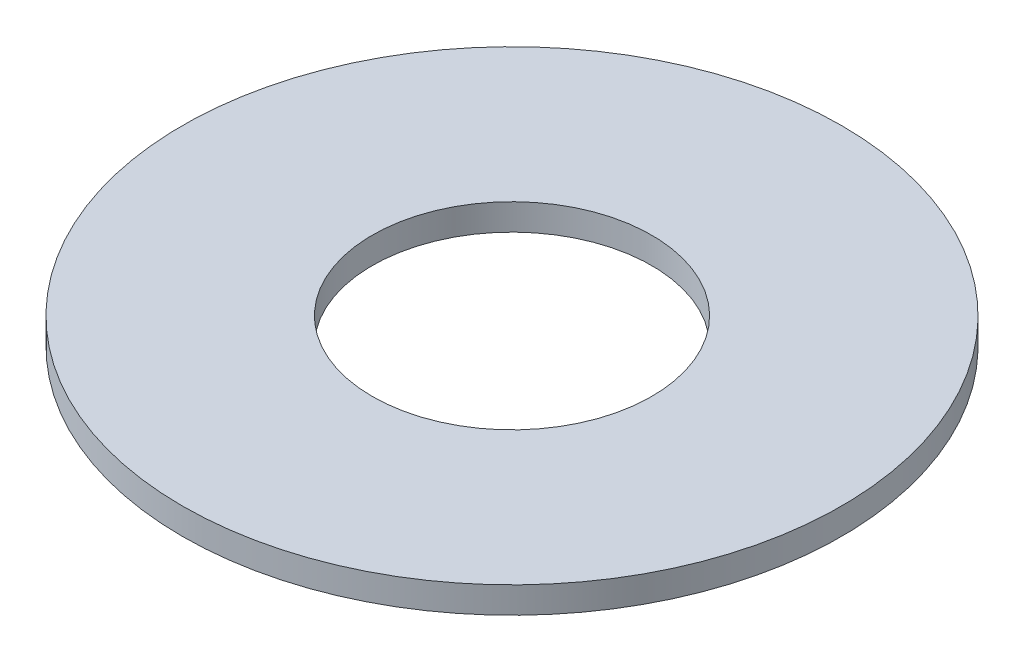
ISO-10303-21;
HEADER;
FILE_DESCRIPTION(('STEP AP214'),'2;1');
FILE_NAME('part.step','',(''),(''),'','','');
FILE_SCHEMA(('AUTOMOTIVE_DESIGN { 1 0 10303 214 1 1 1 1 }'));
ENDSEC;
DATA;
#1=APPLICATION_CONTEXT('core data for automotive mechanical design processes');
#2=APPLICATION_PROTOCOL_DEFINITION('international standard','automotive_design',2000,#1);
#3=PRODUCT_CONTEXT('',#1,'mechanical');
#4=PRODUCT('Part','Part','',(#3));
#5=PRODUCT_RELATED_PRODUCT_CATEGORY('part','',(#4));
#6=PRODUCT_DEFINITION_FORMATION('','',#4);
#7=PRODUCT_DEFINITION_CONTEXT('part definition',#1,'design');
#8=PRODUCT_DEFINITION('design','',#6,#7);
#9=PRODUCT_DEFINITION_SHAPE('','',#8);
#10=(LENGTH_UNIT() NAMED_UNIT(*) SI_UNIT(.MILLI.,.METRE.));
#11=(NAMED_UNIT(*) PLANE_ANGLE_UNIT() SI_UNIT($,.RADIAN.));
#12=(NAMED_UNIT(*) SI_UNIT($,.STERADIAN.) SOLID_ANGLE_UNIT());
#13=UNCERTAINTY_MEASURE_WITH_UNIT(LENGTH_MEASURE(1.E-05),#10,'distance_accuracy_value','');
#14=(GEOMETRIC_REPRESENTATION_CONTEXT(3) GLOBAL_UNCERTAINTY_ASSIGNED_CONTEXT((#13)) GLOBAL_UNIT_ASSIGNED_CONTEXT((#10,
#11,#12)) REPRESENTATION_CONTEXT('',''));
#15=CARTESIAN_POINT('',(0.,0.,0.));
#16=DIRECTION('',(0.,0.,1.));
#17=DIRECTION('',(1.,0.,0.));
#18=AXIS2_PLACEMENT_3D('',#15,#16,#17);
#19=CARTESIAN_POINT('',(0.,0.5,0.));
#20=DIRECTION('',(0.,1.,0.));
#21=DIRECTION('',(0.,0.,1.));
#22=AXIS2_PLACEMENT_3D('',#19,#20,#21);
#23=PLANE('',#22);
#24=CARTESIAN_POINT('',(0.,0.5,0.));
#25=DIRECTION('',(0.,1.,0.));
#26=DIRECTION('',(0.,0.,1.));
#27=AXIS2_PLACEMENT_3D('',#24,#25,#26);
#28=CIRCLE('',#27,12.5);
#29=CARTESIAN_POINT('',(0.,0.5,12.5));
#30=VERTEX_POINT('',#29);
#31=EDGE_CURVE('E10',#30,#30,#28,.T.);
#32=ORIENTED_EDGE('',*,*,#31,.T.);
#33=EDGE_LOOP('',(#32));
#34=FACE_BOUND('',#33,.T.);
#35=CARTESIAN_POINT('',(0.,0.5,0.));
#36=DIRECTION('',(0.,1.,0.));
#37=DIRECTION('',(0.,0.,1.));
#38=AXIS2_PLACEMENT_3D('',#35,#36,#37);
#39=CIRCLE('',#38,5.3);
#40=CARTESIAN_POINT('',(0.,0.5,5.3));
#41=VERTEX_POINT('',#40);
#42=EDGE_CURVE('E48',#41,#41,#39,.T.);
#43=ORIENTED_EDGE('',*,*,#42,.F.);
#44=EDGE_LOOP('',(#43));
#45=FACE_BOUND('',#44,.T.);
#46=ADVANCED_FACE('F37',(#34,#45),#23,.T.);
#47=CARTESIAN_POINT('',(0.,-0.5,0.));
#48=DIRECTION('',(0.,1.,0.));
#49=DIRECTION('',(0.,0.,1.));
#50=AXIS2_PLACEMENT_3D('',#47,#48,#49);
#51=PLANE('',#50);
#52=CARTESIAN_POINT('',(0.,-0.5,0.));
#53=DIRECTION('',(0.,1.,0.));
#54=DIRECTION('',(0.,0.,1.));
#55=AXIS2_PLACEMENT_3D('',#52,#53,#54);
#56=CIRCLE('',#55,12.5);
#57=CARTESIAN_POINT('',(0.,-0.5,12.5));
#58=VERTEX_POINT('',#57);
#59=EDGE_CURVE('E41',#58,#58,#56,.T.);
#60=ORIENTED_EDGE('',*,*,#59,.F.);
#61=EDGE_LOOP('',(#60));
#62=FACE_BOUND('',#61,.T.);
#63=CARTESIAN_POINT('',(0.,-0.5,0.));
#64=DIRECTION('',(0.,1.,0.));
#65=DIRECTION('',(0.,0.,1.));
#66=AXIS2_PLACEMENT_3D('',#63,#64,#65);
#67=CIRCLE('',#66,5.3);
#68=CARTESIAN_POINT('',(0.,-0.5,5.3));
#69=VERTEX_POINT('',#68);
#70=EDGE_CURVE('E50',#69,#69,#67,.T.);
#71=ORIENTED_EDGE('',*,*,#70,.T.);
#72=EDGE_LOOP('',(#71));
#73=FACE_BOUND('',#72,.T.);
#74=ADVANCED_FACE('F60',(#62,#73),#51,.F.);
#75=CARTESIAN_POINT('',(0.,0.5,0.));
#76=DIRECTION('',(0.,-1.,0.));
#77=DIRECTION('',(0.,0.,-1.));
#78=AXIS2_PLACEMENT_3D('',#75,#76,#77);
#79=CYLINDRICAL_SURFACE('',#78,12.5);
#80=ORIENTED_EDGE('',*,*,#31,.F.);
#81=EDGE_LOOP('',(#80));
#82=FACE_BOUND('',#81,.T.);
#83=ORIENTED_EDGE('',*,*,#59,.T.);
#84=EDGE_LOOP('',(#83));
#85=FACE_BOUND('',#84,.T.);
#86=ADVANCED_FACE('F39',(#82,#85),#79,.T.);
#87=CARTESIAN_POINT('',(0.,0.5,0.));
#88=DIRECTION('',(0.,-1.,0.));
#89=DIRECTION('',(0.,0.,-1.));
#90=AXIS2_PLACEMENT_3D('',#87,#88,#89);
#91=CYLINDRICAL_SURFACE('',#90,5.3);
#92=ORIENTED_EDGE('',*,*,#42,.T.);
#93=EDGE_LOOP('',(#92));
#94=FACE_BOUND('',#93,.T.);
#95=ORIENTED_EDGE('',*,*,#70,.F.);
#96=EDGE_LOOP('',(#95));
#97=FACE_BOUND('',#96,.T.);
#98=ADVANCED_FACE('F56',(#94,#97),#91,.F.);
#99=CLOSED_SHELL('',(#46,#74,#86,#98));
#100=MANIFOLD_SOLID_BREP('B2',#99);
#101=ADVANCED_BREP_SHAPE_REPRESENTATION('',(#18,#100),#14);
#102=SHAPE_DEFINITION_REPRESENTATION(#9,#101);
ENDSEC;
END-ISO-10303-21;
